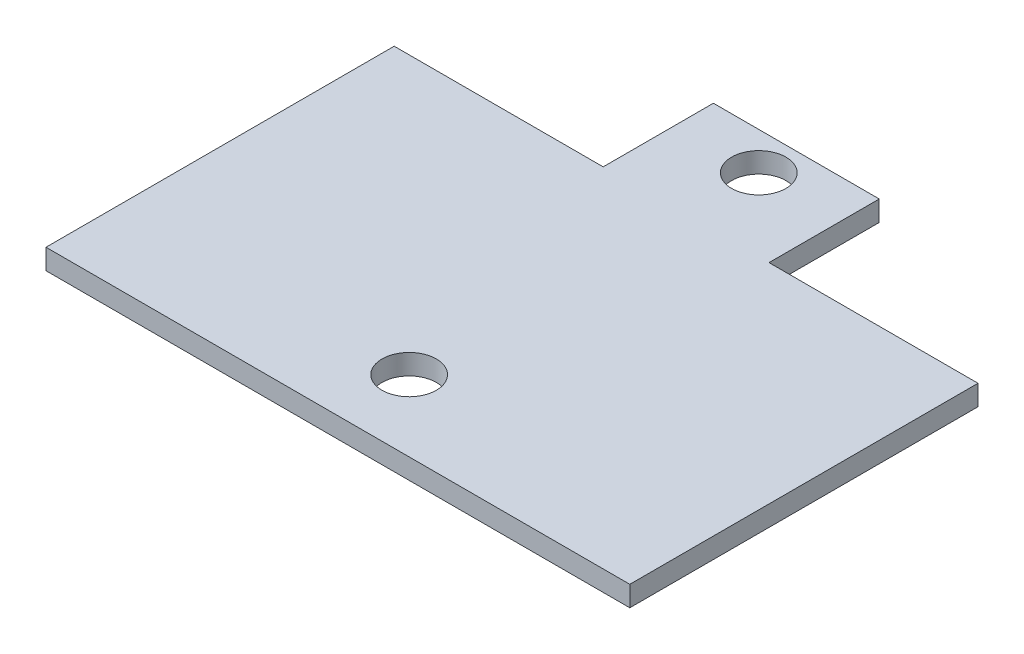
ISO-10303-21;
HEADER;
FILE_DESCRIPTION(('STEP AP214'),'2;1');
FILE_NAME('part.step','',(''),(''),'','','');
FILE_SCHEMA(('AUTOMOTIVE_DESIGN { 1 0 10303 214 1 1 1 1 }'));
ENDSEC;
DATA;
#1=APPLICATION_CONTEXT('core data for automotive mechanical design processes');
#2=APPLICATION_PROTOCOL_DEFINITION('international standard','automotive_design',2000,#1);
#3=PRODUCT_CONTEXT('',#1,'mechanical');
#4=PRODUCT('Part','Part','',(#3));
#5=PRODUCT_RELATED_PRODUCT_CATEGORY('part','',(#4));
#6=PRODUCT_DEFINITION_FORMATION('','',#4);
#7=PRODUCT_DEFINITION_CONTEXT('part definition',#1,'design');
#8=PRODUCT_DEFINITION('design','',#6,#7);
#9=PRODUCT_DEFINITION_SHAPE('','',#8);
#10=(LENGTH_UNIT() NAMED_UNIT(*) SI_UNIT(.MILLI.,.METRE.));
#11=(NAMED_UNIT(*) PLANE_ANGLE_UNIT() SI_UNIT($,.RADIAN.));
#12=(NAMED_UNIT(*) SI_UNIT($,.STERADIAN.) SOLID_ANGLE_UNIT());
#13=UNCERTAINTY_MEASURE_WITH_UNIT(LENGTH_MEASURE(1.E-05),#10,'distance_accuracy_value','');
#14=(GEOMETRIC_REPRESENTATION_CONTEXT(3) GLOBAL_UNCERTAINTY_ASSIGNED_CONTEXT((#13)) GLOBAL_UNIT_ASSIGNED_CONTEXT((#10,
#11,#12)) REPRESENTATION_CONTEXT('',''));
#15=CARTESIAN_POINT('',(0.,0.,0.));
#16=DIRECTION('',(0.,0.,1.));
#17=DIRECTION('',(1.,0.,0.));
#18=AXIS2_PLACEMENT_3D('',#15,#16,#17);
#19=CARTESIAN_POINT('',(0.,1.5,0.));
#20=DIRECTION('',(0.,-1.,0.));
#21=DIRECTION('',(0.,0.,-1.));
#22=AXIS2_PLACEMENT_3D('',#19,#20,#21);
#23=PLANE('',#22);
#24=DIRECTION('',(0.,0.,1.));
#25=VECTOR('',#24,1.);
#26=CARTESIAN_POINT('',(0.,1.5,0.));
#27=LINE('',#26,#25);
#28=CARTESIAN_POINT('',(0.,1.5,-25.6464684047065));
#29=VERTEX_POINT('',#28);
#30=CARTESIAN_POINT('',(0.,1.5,0.));
#31=VERTEX_POINT('',#30);
#32=EDGE_CURVE('E145',#29,#31,#27,.T.);
#33=ORIENTED_EDGE('',*,*,#32,.T.);
#34=DIRECTION('',(1.,0.,0.));
#35=VECTOR('',#34,1.);
#36=CARTESIAN_POINT('',(0.,1.5,0.));
#37=LINE('',#36,#35);
#38=CARTESIAN_POINT('',(43.,1.5,0.));
#39=VERTEX_POINT('',#38);
#40=EDGE_CURVE('E93',#31,#39,#37,.T.);
#41=ORIENTED_EDGE('',*,*,#40,.T.);
#42=DIRECTION('',(0.,0.,-1.));
#43=VECTOR('',#42,1.);
#44=CARTESIAN_POINT('',(43.,1.5,0.));
#45=LINE('',#44,#43);
#46=CARTESIAN_POINT('',(43.,1.5,-25.6464684047065));
#47=VERTEX_POINT('',#46);
#48=EDGE_CURVE('E160',#39,#47,#45,.T.);
#49=ORIENTED_EDGE('',*,*,#48,.T.);
#50=DIRECTION('',(-1.,0.,0.));
#51=VECTOR('',#50,1.);
#52=CARTESIAN_POINT('',(27.6077193145106,1.5,-25.6464684047065));
#53=LINE('',#52,#51);
#54=CARTESIAN_POINT('',(27.6077193145106,1.5,-25.6464684047065));
#55=VERTEX_POINT('',#54);
#56=EDGE_CURVE('E173',#47,#55,#53,.T.);
#57=ORIENTED_EDGE('',*,*,#56,.T.);
#58=DIRECTION('',(0.,0.,-1.));
#59=VECTOR('',#58,1.);
#60=CARTESIAN_POINT('',(27.6077193145106,1.5,-33.7649124070522));
#61=LINE('',#60,#59);
#62=CARTESIAN_POINT('',(27.6077193145106,1.5,-33.7649124070522));
#63=VERTEX_POINT('',#62);
#64=EDGE_CURVE('E112',#55,#63,#61,.T.);
#65=ORIENTED_EDGE('',*,*,#64,.T.);
#66=DIRECTION('',(-1.,0.,0.));
#67=VECTOR('',#66,1.);
#68=CARTESIAN_POINT('',(15.3922806854894,1.5,-33.7649124070522));
#69=LINE('',#68,#67);
#70=CARTESIAN_POINT('',(15.3922806854894,1.5,-33.7649124070522));
#71=VERTEX_POINT('',#70);
#72=EDGE_CURVE('E106',#63,#71,#69,.T.);
#73=ORIENTED_EDGE('',*,*,#72,.T.);
#74=DIRECTION('',(0.,0.,1.));
#75=VECTOR('',#74,1.);
#76=CARTESIAN_POINT('',(15.3922806854894,1.5,-25.6464684047065));
#77=LINE('',#76,#75);
#78=CARTESIAN_POINT('',(15.3922806854894,1.5,-25.6464684047065));
#79=VERTEX_POINT('',#78);
#80=EDGE_CURVE('E110',#71,#79,#77,.T.);
#81=ORIENTED_EDGE('',*,*,#80,.T.);
#82=DIRECTION('',(-1.,0.,0.));
#83=VECTOR('',#82,1.);
#84=CARTESIAN_POINT('',(0.,1.5,-25.6464684047065));
#85=LINE('',#84,#83);
#86=EDGE_CURVE('E50',#79,#29,#85,.T.);
#87=ORIENTED_EDGE('',*,*,#86,.T.);
#88=EDGE_LOOP('',(#33,#41,#49,#57,#65,#73,#81,#87));
#89=FACE_BOUND('',#88,.T.);
#90=CARTESIAN_POINT('',(21.5,1.5,-31.));
#91=DIRECTION('',(0.,1.,0.));
#92=DIRECTION('',(0.,0.,-1.));
#93=AXIS2_PLACEMENT_3D('',#90,#91,#92);
#94=CIRCLE('',#93,2.);
#95=CARTESIAN_POINT('',(21.5,1.5,-33.));
#96=VERTEX_POINT('',#95);
#97=EDGE_CURVE('E134',#96,#96,#94,.T.);
#98=ORIENTED_EDGE('',*,*,#97,.F.);
#99=EDGE_LOOP('',(#98));
#100=FACE_BOUND('',#99,.T.);
#101=CARTESIAN_POINT('',(21.5,1.5,-5.25));
#102=DIRECTION('',(0.,1.,0.));
#103=DIRECTION('',(0.,0.,-1.));
#104=AXIS2_PLACEMENT_3D('',#101,#102,#103);
#105=CIRCLE('',#104,2.);
#106=CARTESIAN_POINT('',(21.5,1.5,-7.25));
#107=VERTEX_POINT('',#106);
#108=EDGE_CURVE('E182',#107,#107,#105,.T.);
#109=ORIENTED_EDGE('',*,*,#108,.F.);
#110=EDGE_LOOP('',(#109));
#111=FACE_BOUND('',#110,.T.);
#112=ADVANCED_FACE('F33',(#89,#100,#111),#23,.F.);
#113=CARTESIAN_POINT('',(0.,0.,0.));
#114=DIRECTION('',(0.,-1.,0.));
#115=DIRECTION('',(0.,0.,-1.));
#116=AXIS2_PLACEMENT_3D('',#113,#114,#115);
#117=PLANE('',#116);
#118=CARTESIAN_POINT('',(21.5,0.,-31.));
#119=DIRECTION('',(0.,1.,0.));
#120=DIRECTION('',(0.,0.,-1.));
#121=AXIS2_PLACEMENT_3D('',#118,#119,#120);
#122=CIRCLE('',#121,2.);
#123=CARTESIAN_POINT('',(21.5,0.,-33.));
#124=VERTEX_POINT('',#123);
#125=EDGE_CURVE('E179',#124,#124,#122,.T.);
#126=ORIENTED_EDGE('',*,*,#125,.T.);
#127=EDGE_LOOP('',(#126));
#128=FACE_BOUND('',#127,.T.);
#129=DIRECTION('',(0.,0.,1.));
#130=VECTOR('',#129,1.);
#131=CARTESIAN_POINT('',(0.,0.,0.));
#132=LINE('',#131,#130);
#133=CARTESIAN_POINT('',(0.,0.,-25.6464684047065));
#134=VERTEX_POINT('',#133);
#135=CARTESIAN_POINT('',(0.,0.,0.));
#136=VERTEX_POINT('',#135);
#137=EDGE_CURVE('E130',#134,#136,#132,.T.);
#138=ORIENTED_EDGE('',*,*,#137,.F.);
#139=DIRECTION('',(-1.,0.,0.));
#140=VECTOR('',#139,1.);
#141=CARTESIAN_POINT('',(0.,0.,-25.6464684047065));
#142=LINE('',#141,#140);
#143=CARTESIAN_POINT('',(15.3922806854894,0.,-25.6464684047065));
#144=VERTEX_POINT('',#143);
#145=EDGE_CURVE('E85',#144,#134,#142,.T.);
#146=ORIENTED_EDGE('',*,*,#145,.F.);
#147=DIRECTION('',(0.,0.,1.));
#148=VECTOR('',#147,1.);
#149=CARTESIAN_POINT('',(15.3922806854894,0.,-25.6464684047065));
#150=LINE('',#149,#148);
#151=CARTESIAN_POINT('',(15.3922806854894,0.,-33.7649124070522));
#152=VERTEX_POINT('',#151);
#153=EDGE_CURVE('E79',#152,#144,#150,.T.);
#154=ORIENTED_EDGE('',*,*,#153,.F.);
#155=DIRECTION('',(-1.,0.,0.));
#156=VECTOR('',#155,1.);
#157=CARTESIAN_POINT('',(15.3922806854894,0.,-33.7649124070522));
#158=LINE('',#157,#156);
#159=CARTESIAN_POINT('',(27.6077193145106,0.,-33.7649124070522));
#160=VERTEX_POINT('',#159);
#161=EDGE_CURVE('E120',#160,#152,#158,.T.);
#162=ORIENTED_EDGE('',*,*,#161,.F.);
#163=DIRECTION('',(0.,0.,-1.));
#164=VECTOR('',#163,1.);
#165=CARTESIAN_POINT('',(27.6077193145106,0.,-33.7649124070522));
#166=LINE('',#165,#164);
#167=CARTESIAN_POINT('',(27.6077193145106,0.,-25.6464684047065));
#168=VERTEX_POINT('',#167);
#169=EDGE_CURVE('E140',#168,#160,#166,.T.);
#170=ORIENTED_EDGE('',*,*,#169,.F.);
#171=DIRECTION('',(-1.,0.,0.));
#172=VECTOR('',#171,1.);
#173=CARTESIAN_POINT('',(27.6077193145106,0.,-25.6464684047065));
#174=LINE('',#173,#172);
#175=CARTESIAN_POINT('',(43.,0.,-25.6464684047065));
#176=VERTEX_POINT('',#175);
#177=EDGE_CURVE('E138',#176,#168,#174,.T.);
#178=ORIENTED_EDGE('',*,*,#177,.F.);
#179=DIRECTION('',(0.,0.,-1.));
#180=VECTOR('',#179,1.);
#181=CARTESIAN_POINT('',(43.,0.,0.));
#182=LINE('',#181,#180);
#183=CARTESIAN_POINT('',(43.,0.,0.));
#184=VERTEX_POINT('',#183);
#185=EDGE_CURVE('E136',#184,#176,#182,.T.);
#186=ORIENTED_EDGE('',*,*,#185,.F.);
#187=DIRECTION('',(1.,0.,0.));
#188=VECTOR('',#187,1.);
#189=CARTESIAN_POINT('',(0.,0.,0.));
#190=LINE('',#189,#188);
#191=EDGE_CURVE('E133',#136,#184,#190,.T.);
#192=ORIENTED_EDGE('',*,*,#191,.F.);
#193=EDGE_LOOP('',(#138,#146,#154,#162,#170,#178,#186,#192));
#194=FACE_BOUND('',#193,.T.);
#195=CARTESIAN_POINT('',(21.5,0.,-5.25));
#196=DIRECTION('',(0.,1.,0.));
#197=DIRECTION('',(0.,0.,-1.));
#198=AXIS2_PLACEMENT_3D('',#195,#196,#197);
#199=CIRCLE('',#198,2.);
#200=CARTESIAN_POINT('',(21.5,0.,-7.25));
#201=VERTEX_POINT('',#200);
#202=EDGE_CURVE('E185',#201,#201,#199,.T.);
#203=ORIENTED_EDGE('',*,*,#202,.T.);
#204=EDGE_LOOP('',(#203));
#205=FACE_BOUND('',#204,.T.);
#206=ADVANCED_FACE('F164',(#128,#194,#205),#117,.T.);
#207=CARTESIAN_POINT('',(0.,1.5,0.));
#208=DIRECTION('',(1.,0.,0.));
#209=DIRECTION('',(0.,0.,-1.));
#210=AXIS2_PLACEMENT_3D('',#207,#208,#209);
#211=PLANE('',#210);
#212=ORIENTED_EDGE('',*,*,#137,.T.);
#213=DIRECTION('',(0.,-1.,0.));
#214=VECTOR('',#213,1.);
#215=CARTESIAN_POINT('',(0.,1.5,0.));
#216=LINE('',#215,#214);
#217=EDGE_CURVE('E11',#31,#136,#216,.T.);
#218=ORIENTED_EDGE('',*,*,#217,.F.);
#219=ORIENTED_EDGE('',*,*,#32,.F.);
#220=DIRECTION('',(0.,-1.,0.));
#221=VECTOR('',#220,1.);
#222=CARTESIAN_POINT('',(0.,1.5,-25.6464684047065));
#223=LINE('',#222,#221);
#224=EDGE_CURVE('E126',#29,#134,#223,.T.);
#225=ORIENTED_EDGE('',*,*,#224,.T.);
#226=EDGE_LOOP('',(#212,#218,#219,#225));
#227=FACE_BOUND('',#226,.T.);
#228=ADVANCED_FACE('F35',(#227),#211,.F.);
#229=CARTESIAN_POINT('',(0.,1.5,0.));
#230=DIRECTION('',(0.,0.,-1.));
#231=DIRECTION('',(-1.,0.,0.));
#232=AXIS2_PLACEMENT_3D('',#229,#230,#231);
#233=PLANE('',#232);
#234=ORIENTED_EDGE('',*,*,#191,.T.);
#235=DIRECTION('',(0.,-1.,0.));
#236=VECTOR('',#235,1.);
#237=CARTESIAN_POINT('',(43.,1.5,0.));
#238=LINE('',#237,#236);
#239=EDGE_CURVE('E42',#39,#184,#238,.T.);
#240=ORIENTED_EDGE('',*,*,#239,.F.);
#241=ORIENTED_EDGE('',*,*,#40,.F.);
#242=ORIENTED_EDGE('',*,*,#217,.T.);
#243=EDGE_LOOP('',(#234,#240,#241,#242));
#244=FACE_BOUND('',#243,.T.);
#245=ADVANCED_FACE('F217',(#244),#233,.F.);
#246=CARTESIAN_POINT('',(43.,1.5,0.));
#247=DIRECTION('',(-1.,0.,0.));
#248=DIRECTION('',(0.,0.,1.));
#249=AXIS2_PLACEMENT_3D('',#246,#247,#248);
#250=PLANE('',#249);
#251=ORIENTED_EDGE('',*,*,#185,.T.);
#252=DIRECTION('',(0.,-1.,0.));
#253=VECTOR('',#252,1.);
#254=CARTESIAN_POINT('',(43.,1.5,-25.6464684047065));
#255=LINE('',#254,#253);
#256=EDGE_CURVE('E152',#47,#176,#255,.T.);
#257=ORIENTED_EDGE('',*,*,#256,.F.);
#258=ORIENTED_EDGE('',*,*,#48,.F.);
#259=ORIENTED_EDGE('',*,*,#239,.T.);
#260=EDGE_LOOP('',(#251,#257,#258,#259));
#261=FACE_BOUND('',#260,.T.);
#262=ADVANCED_FACE('F158',(#261),#250,.F.);
#263=CARTESIAN_POINT('',(27.6077193145106,1.5,-25.6464684047065));
#264=DIRECTION('',(0.,0.,1.));
#265=DIRECTION('',(1.,0.,0.));
#266=AXIS2_PLACEMENT_3D('',#263,#264,#265);
#267=PLANE('',#266);
#268=ORIENTED_EDGE('',*,*,#177,.T.);
#269=DIRECTION('',(0.,-1.,0.));
#270=VECTOR('',#269,1.);
#271=CARTESIAN_POINT('',(27.6077193145106,1.5,-25.6464684047065));
#272=LINE('',#271,#270);
#273=EDGE_CURVE('E149',#55,#168,#272,.T.);
#274=ORIENTED_EDGE('',*,*,#273,.F.);
#275=ORIENTED_EDGE('',*,*,#56,.F.);
#276=ORIENTED_EDGE('',*,*,#256,.T.);
#277=EDGE_LOOP('',(#268,#274,#275,#276));
#278=FACE_BOUND('',#277,.T.);
#279=ADVANCED_FACE('F169',(#278),#267,.F.);
#280=CARTESIAN_POINT('',(27.6077193145106,1.5,-33.7649124070522));
#281=DIRECTION('',(-1.,0.,0.));
#282=DIRECTION('',(0.,0.,1.));
#283=AXIS2_PLACEMENT_3D('',#280,#281,#282);
#284=PLANE('',#283);
#285=ORIENTED_EDGE('',*,*,#169,.T.);
#286=DIRECTION('',(0.,-1.,0.));
#287=VECTOR('',#286,1.);
#288=CARTESIAN_POINT('',(27.6077193145106,1.5,-33.7649124070522));
#289=LINE('',#288,#287);
#290=EDGE_CURVE('E121',#63,#160,#289,.T.);
#291=ORIENTED_EDGE('',*,*,#290,.F.);
#292=ORIENTED_EDGE('',*,*,#64,.F.);
#293=ORIENTED_EDGE('',*,*,#273,.T.);
#294=EDGE_LOOP('',(#285,#291,#292,#293));
#295=FACE_BOUND('',#294,.T.);
#296=ADVANCED_FACE('F172',(#295),#284,.F.);
#297=CARTESIAN_POINT('',(15.3922806854894,1.5,-33.7649124070522));
#298=DIRECTION('',(0.,0.,1.));
#299=DIRECTION('',(1.,0.,0.));
#300=AXIS2_PLACEMENT_3D('',#297,#298,#299);
#301=PLANE('',#300);
#302=ORIENTED_EDGE('',*,*,#161,.T.);
#303=DIRECTION('',(0.,-1.,0.));
#304=VECTOR('',#303,1.);
#305=CARTESIAN_POINT('',(15.3922806854894,1.5,-33.7649124070522));
#306=LINE('',#305,#304);
#307=EDGE_CURVE('E117',#71,#152,#306,.T.);
#308=ORIENTED_EDGE('',*,*,#307,.F.);
#309=ORIENTED_EDGE('',*,*,#72,.F.);
#310=ORIENTED_EDGE('',*,*,#290,.T.);
#311=EDGE_LOOP('',(#302,#308,#309,#310));
#312=FACE_BOUND('',#311,.T.);
#313=ADVANCED_FACE('F118',(#312),#301,.F.);
#314=CARTESIAN_POINT('',(15.3922806854894,1.5,-25.6464684047065));
#315=DIRECTION('',(1.,0.,0.));
#316=DIRECTION('',(0.,0.,-1.));
#317=AXIS2_PLACEMENT_3D('',#314,#315,#316);
#318=PLANE('',#317);
#319=ORIENTED_EDGE('',*,*,#153,.T.);
#320=DIRECTION('',(0.,-1.,0.));
#321=VECTOR('',#320,1.);
#322=CARTESIAN_POINT('',(15.3922806854894,1.5,-25.6464684047065));
#323=LINE('',#322,#321);
#324=EDGE_CURVE('E122',#79,#144,#323,.T.);
#325=ORIENTED_EDGE('',*,*,#324,.F.);
#326=ORIENTED_EDGE('',*,*,#80,.F.);
#327=ORIENTED_EDGE('',*,*,#307,.T.);
#328=EDGE_LOOP('',(#319,#325,#326,#327));
#329=FACE_BOUND('',#328,.T.);
#330=ADVANCED_FACE('F124',(#329),#318,.F.);
#331=CARTESIAN_POINT('',(0.,1.5,-25.6464684047065));
#332=DIRECTION('',(0.,0.,1.));
#333=DIRECTION('',(1.,0.,0.));
#334=AXIS2_PLACEMENT_3D('',#331,#332,#333);
#335=PLANE('',#334);
#336=ORIENTED_EDGE('',*,*,#145,.T.);
#337=ORIENTED_EDGE('',*,*,#224,.F.);
#338=ORIENTED_EDGE('',*,*,#86,.F.);
#339=ORIENTED_EDGE('',*,*,#324,.T.);
#340=EDGE_LOOP('',(#336,#337,#338,#339));
#341=FACE_BOUND('',#340,.T.);
#342=ADVANCED_FACE('F205',(#341),#335,.F.);
#343=CARTESIAN_POINT('',(21.5,1.5,-31.));
#344=DIRECTION('',(0.,-1.,0.));
#345=DIRECTION('',(0.,0.,-1.));
#346=AXIS2_PLACEMENT_3D('',#343,#344,#345);
#347=CYLINDRICAL_SURFACE('',#346,2.);
#348=ORIENTED_EDGE('',*,*,#97,.T.);
#349=EDGE_LOOP('',(#348));
#350=FACE_BOUND('',#349,.T.);
#351=ORIENTED_EDGE('',*,*,#125,.F.);
#352=EDGE_LOOP('',(#351));
#353=FACE_BOUND('',#352,.T.);
#354=ADVANCED_FACE('F202',(#350,#353),#347,.F.);
#355=CARTESIAN_POINT('',(21.5,1.5,-5.25));
#356=DIRECTION('',(0.,-1.,0.));
#357=DIRECTION('',(0.,0.,-1.));
#358=AXIS2_PLACEMENT_3D('',#355,#356,#357);
#359=CYLINDRICAL_SURFACE('',#358,2.);
#360=ORIENTED_EDGE('',*,*,#108,.T.);
#361=EDGE_LOOP('',(#360));
#362=FACE_BOUND('',#361,.T.);
#363=ORIENTED_EDGE('',*,*,#202,.F.);
#364=EDGE_LOOP('',(#363));
#365=FACE_BOUND('',#364,.T.);
#366=ADVANCED_FACE('F191',(#362,#365),#359,.F.);
#367=CLOSED_SHELL('',(#112,#206,#228,#245,#262,#279,#296,#313,#330,#342,#354,#366));
#368=MANIFOLD_SOLID_BREP('B2',#367);
#369=ADVANCED_BREP_SHAPE_REPRESENTATION('',(#18,#368),#14);
#370=SHAPE_DEFINITION_REPRESENTATION(#9,#369);
ENDSEC;
END-ISO-10303-21;
